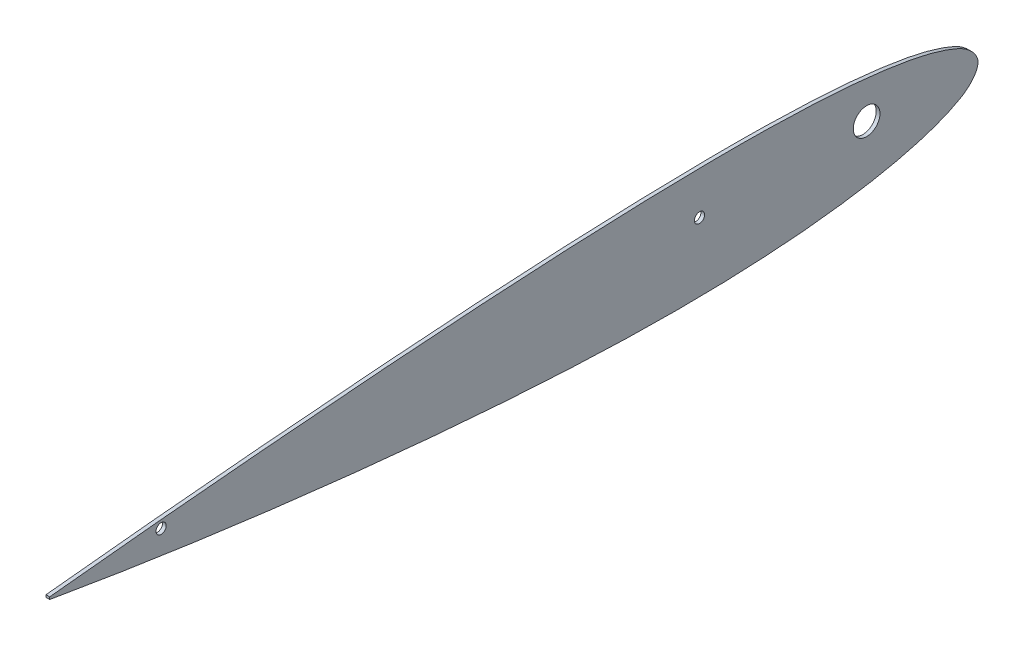
ISO-10303-21;
HEADER;
FILE_DESCRIPTION(('STEP AP214'),'2;1');
FILE_NAME('part.step','',(''),(''),'','','');
FILE_SCHEMA(('AUTOMOTIVE_DESIGN { 1 0 10303 214 1 1 1 1 }'));
ENDSEC;
DATA;
#1=APPLICATION_CONTEXT('core data for automotive mechanical design processes');
#2=APPLICATION_PROTOCOL_DEFINITION('international standard','automotive_design',2000,#1);
#3=PRODUCT_CONTEXT('',#1,'mechanical');
#4=PRODUCT('Part','Part','',(#3));
#5=PRODUCT_RELATED_PRODUCT_CATEGORY('part','',(#4));
#6=PRODUCT_DEFINITION_FORMATION('','',#4);
#7=PRODUCT_DEFINITION_CONTEXT('part definition',#1,'design');
#8=PRODUCT_DEFINITION('design','',#6,#7);
#9=PRODUCT_DEFINITION_SHAPE('','',#8);
#10=(LENGTH_UNIT() NAMED_UNIT(*) SI_UNIT(.MILLI.,.METRE.));
#11=(NAMED_UNIT(*) PLANE_ANGLE_UNIT() SI_UNIT($,.RADIAN.));
#12=(NAMED_UNIT(*) SI_UNIT($,.STERADIAN.) SOLID_ANGLE_UNIT());
#13=UNCERTAINTY_MEASURE_WITH_UNIT(LENGTH_MEASURE(1.E-05),#10,'distance_accuracy_value','');
#14=(GEOMETRIC_REPRESENTATION_CONTEXT(3) GLOBAL_UNCERTAINTY_ASSIGNED_CONTEXT((#13)) GLOBAL_UNIT_ASSIGNED_CONTEXT((#10,
#11,#12)) REPRESENTATION_CONTEXT('',''));
#15=CARTESIAN_POINT('',(0.,0.,0.));
#16=DIRECTION('',(0.,0.,1.));
#17=DIRECTION('',(1.,0.,0.));
#18=AXIS2_PLACEMENT_3D('',#15,#16,#17);
#19=CARTESIAN_POINT('',(2.,0.629990217552887,500.000391464518));
#20=CARTESIAN_POINT('',(2.,1.51034175126108,491.626931192415));
#21=CARTESIAN_POINT('',(2.,3.26887282570173,474.900669551157));
#22=CARTESIAN_POINT('',(2.,6.57755116135666,441.478024901199));
#23=CARTESIAN_POINT('',(2.,10.4506062125908,399.75968393433));
#24=CARTESIAN_POINT('',(2.,14.7211772633211,349.744612358999));
#25=CARTESIAN_POINT('',(2.,18.5892936363402,299.79981397499));
#26=CARTESIAN_POINT('',(2.,21.8953680882773,249.907411219679));
#27=CARTESIAN_POINT('',(2.,24.3721381282665,200.117341253644));
#28=CARTESIAN_POINT('',(2.,25.5592845892216,158.671272756386));
#29=CARTESIAN_POINT('',(2.,25.7289283148688,125.568151797292));
#30=CARTESIAN_POINT('',(2.,25.3055282165276,100.710481376144));
#31=CARTESIAN_POINT('',(2.,24.1073804683215,75.7898961207131));
#32=CARTESIAN_POINT('',(2.,22.1864488821257,54.9819243378212));
#33=CARTESIAN_POINT('',(2.,19.6696784029122,38.2826088337678));
#34=CARTESIAN_POINT('',(2.,17.0750296516133,25.6214069700581));
#35=CARTESIAN_POINT('',(2.,13.6752084008964,14.8526657949537));
#36=CARTESIAN_POINT('',(2.,9.34354366510016,5.48115663478327));
#37=CARTESIAN_POINT('',(2.,0.464115322413722,-3.05752115720103));
#38=CARTESIAN_POINT('',(2.,-9.25154410103212,4.56290295265366));
#39=CARTESIAN_POINT('',(2.,-14.4440662930239,13.5406941054071));
#40=CARTESIAN_POINT('',(2.,-18.8274349648793,24.0380165714359));
#41=CARTESIAN_POINT('',(2.,-22.5007793217448,36.5482015339728));
#42=CARTESIAN_POINT('',(2.,-26.3525527265861,53.1842112016427));
#43=CARTESIAN_POINT('',(2.,-29.7119988712829,74.0823714612029));
#44=CARTESIAN_POINT('',(2.,-32.3644363625232,99.2384453704401));
#45=CARTESIAN_POINT('',(2.,-33.8981341858284,124.417757669678));
#46=CARTESIAN_POINT('',(2.,-34.8427950054599,158.001666326896));
#47=CARTESIAN_POINT('',(2.,-34.1504063706173,199.943449697897));
#48=CARTESIAN_POINT('',(2.,-31.3977787192568,250.163999372924));
#49=CARTESIAN_POINT('',(2.,-27.3265644902248,300.273534791434));
#50=CARTESIAN_POINT('',(2.,-22.1260328840813,350.326490164144));
#51=CARTESIAN_POINT('',(2.,-15.9835680884625,400.319447211552));
#52=CARTESIAN_POINT('',(2.,-10.0706032745586,441.907987538052));
#53=CARTESIAN_POINT('',(2.,-4.87163762297868,475.129555299215));
#54=CARTESIAN_POINT('',(2.,-2.043748956896,491.710316251138));
#55=CARTESIAN_POINT('',(2.,-0.629990217552892,499.999608535483));
#56=B_SPLINE_CURVE_WITH_KNOTS('',3,(#19,#20,#21,#22,#23,#24,#25,#26,#27,#28,#29,#30,#31,#32,#33,
#34,#35,#36,#37,#38,#39,#40,#41,#42,#43,#44,#45,#46,#47,#48,#49,#50,#51,#52,#53,#54,#55),
.UNSPECIFIED.,.F.,.F.,(4,1,1,1,1,1,1,1,1,1,1,1,1,1,1,1,1,1,1,1,1,1,1,1,1,1,1,1,1,1,1,1,1,1,4),
(0.,0.0247898444409783,0.049518527668585,0.0988869468263506,0.148148302407342,0.19731261260843,
0.246378146970664,0.295363956929404,0.34408374332352,0.368442721404916,0.392825641810401,
0.41727490319434,0.441884458853984,0.454325923101425,0.466947515660677,0.480022900195665,
0.487092053261674,0.498227884101779,0.509373674616872,0.516476673346114,0.529639133387933,
0.542377969647895,0.5549439711343,0.579861194114865,0.604653843655577,0.629394084082987,
0.654115914552988,0.703559499032186,0.752843021958462,0.802183907321177,0.851568359011207,
0.900997535580195,0.950476794201679,0.975241647297708,1.),.UNSPECIFIED.);
#57=DIRECTION('',(-1.,0.,0.));
#58=VECTOR('',#57,1.);
#59=SURFACE_OF_LINEAR_EXTRUSION('',#56,#58);
#60=CARTESIAN_POINT('',(0.,0.629990217552887,500.000391464518));
#61=CARTESIAN_POINT('',(0.,1.51034175126108,491.626931192415));
#62=CARTESIAN_POINT('',(0.,3.26887282570173,474.900669551157));
#63=CARTESIAN_POINT('',(0.,6.57755116135666,441.478024901199));
#64=CARTESIAN_POINT('',(0.,10.4506062125908,399.75968393433));
#65=CARTESIAN_POINT('',(0.,14.7211772633211,349.744612358999));
#66=CARTESIAN_POINT('',(0.,18.5892936363402,299.79981397499));
#67=CARTESIAN_POINT('',(0.,21.8953680882773,249.907411219679));
#68=CARTESIAN_POINT('',(0.,24.3721381282665,200.117341253644));
#69=CARTESIAN_POINT('',(0.,25.5592845892216,158.671272756386));
#70=CARTESIAN_POINT('',(0.,25.7289283148688,125.568151797292));
#71=CARTESIAN_POINT('',(0.,25.3055282165276,100.710481376144));
#72=CARTESIAN_POINT('',(0.,24.1073804683215,75.7898961207131));
#73=CARTESIAN_POINT('',(0.,22.1864488821257,54.9819243378212));
#74=CARTESIAN_POINT('',(0.,19.6696784029122,38.2826088337678));
#75=CARTESIAN_POINT('',(0.,17.0750296516133,25.6214069700581));
#76=CARTESIAN_POINT('',(0.,13.6752084008964,14.8526657949537));
#77=CARTESIAN_POINT('',(0.,9.34354366510016,5.48115663478327));
#78=CARTESIAN_POINT('',(0.,0.464115322413722,-3.05752115720103));
#79=CARTESIAN_POINT('',(0.,-9.25154410103212,4.56290295265366));
#80=CARTESIAN_POINT('',(0.,-14.4440662930239,13.5406941054071));
#81=CARTESIAN_POINT('',(0.,-18.8274349648793,24.0380165714359));
#82=CARTESIAN_POINT('',(0.,-22.5007793217448,36.5482015339728));
#83=CARTESIAN_POINT('',(0.,-26.3525527265861,53.1842112016427));
#84=CARTESIAN_POINT('',(0.,-29.7119988712829,74.0823714612029));
#85=CARTESIAN_POINT('',(0.,-32.3644363625232,99.2384453704401));
#86=CARTESIAN_POINT('',(0.,-33.8981341858284,124.417757669678));
#87=CARTESIAN_POINT('',(0.,-34.8427950054599,158.001666326896));
#88=CARTESIAN_POINT('',(0.,-34.1504063706173,199.943449697897));
#89=CARTESIAN_POINT('',(0.,-31.3977787192568,250.163999372924));
#90=CARTESIAN_POINT('',(0.,-27.3265644902248,300.273534791434));
#91=CARTESIAN_POINT('',(0.,-22.1260328840813,350.326490164144));
#92=CARTESIAN_POINT('',(0.,-15.9835680884625,400.319447211552));
#93=CARTESIAN_POINT('',(0.,-10.0706032745586,441.907987538052));
#94=CARTESIAN_POINT('',(0.,-4.87163762297868,475.129555299215));
#95=CARTESIAN_POINT('',(0.,-2.043748956896,491.710316251138));
#96=CARTESIAN_POINT('',(0.,-0.629990217552892,499.999608535483));
#97=B_SPLINE_CURVE_WITH_KNOTS('',3,(#60,#61,#62,#63,#64,#65,#66,#67,#68,#69,#70,#71,#72,#73,#74,
#75,#76,#77,#78,#79,#80,#81,#82,#83,#84,#85,#86,#87,#88,#89,#90,#91,#92,#93,#94,#95,#96),
.UNSPECIFIED.,.F.,.F.,(4,1,1,1,1,1,1,1,1,1,1,1,1,1,1,1,1,1,1,1,1,1,1,1,1,1,1,1,1,1,1,1,1,1,4),
(0.,0.0247898444409783,0.049518527668585,0.0988869468263506,0.148148302407342,0.19731261260843,
0.246378146970664,0.295363956929404,0.34408374332352,0.368442721404916,0.392825641810401,
0.41727490319434,0.441884458853984,0.454325923101425,0.466947515660677,0.480022900195665,
0.487092053261674,0.498227884101779,0.509373674616872,0.516476673346114,0.529639133387933,
0.542377969647895,0.5549439711343,0.579861194114865,0.604653843655577,0.629394084082987,
0.654115914552988,0.703559499032186,0.752843021958462,0.802183907321177,0.851568359011207,
0.900997535580195,0.950476794201679,0.975241647297708,1.),.UNSPECIFIED.);
#98=CARTESIAN_POINT('',(0.,0.629990217552889,500.000391464518));
#99=VERTEX_POINT('',#98);
#100=CARTESIAN_POINT('',(0.,-0.629990217552889,499.999608535482));
#101=VERTEX_POINT('',#100);
#102=EDGE_CURVE('E67',#99,#101,#97,.T.);
#103=ORIENTED_EDGE('',*,*,#102,.F.);
#104=DIRECTION('',(-1.,0.,0.));
#105=VECTOR('',#104,1.);
#106=CARTESIAN_POINT('',(2.,0.629990217552889,500.000391464518));
#107=LINE('',#106,#105);
#108=CARTESIAN_POINT('',(2.,0.629990217552889,500.000391464518));
#109=VERTEX_POINT('',#108);
#110=EDGE_CURVE('E47',#109,#99,#107,.T.);
#111=ORIENTED_EDGE('',*,*,#110,.F.);
#112=CARTESIAN_POINT('',(2.,-0.629990217552889,499.999608535482));
#113=VERTEX_POINT('',#112);
#114=EDGE_CURVE('E68',#109,#113,#56,.T.);
#115=ORIENTED_EDGE('',*,*,#114,.T.);
#116=DIRECTION('',(-1.,0.,0.));
#117=VECTOR('',#116,1.);
#118=CARTESIAN_POINT('',(2.,-0.629990217552889,499.999608535482));
#119=LINE('',#118,#117);
#120=EDGE_CURVE('E11',#113,#101,#119,.T.);
#121=ORIENTED_EDGE('',*,*,#120,.T.);
#122=EDGE_LOOP('',(#103,#111,#115,#121));
#123=FACE_BOUND('',#122,.T.);
#124=ADVANCED_FACE('F37',(#123),#59,.T.);
#125=CARTESIAN_POINT('',(2.,0.629990217552889,500.000391464518));
#126=DIRECTION('',(0.,0.000621381778835644,-0.999999806942324));
#127=DIRECTION('',(0.,-0.999999806942324,-0.000621381778835644));
#128=AXIS2_PLACEMENT_3D('',#125,#126,#127);
#129=PLANE('',#128);
#130=DIRECTION('',(0.,0.999999806942324,0.000621381778835644));
#131=VECTOR('',#130,1.);
#132=CARTESIAN_POINT('',(0.,0.629990217552889,500.000391464518));
#133=LINE('',#132,#131);
#134=EDGE_CURVE('E62',#101,#99,#133,.T.);
#135=ORIENTED_EDGE('',*,*,#134,.F.);
#136=ORIENTED_EDGE('',*,*,#120,.F.);
#137=DIRECTION('',(0.,0.999999806942324,0.000621381778835644));
#138=VECTOR('',#137,1.);
#139=CARTESIAN_POINT('',(2.,0.629990217552889,500.000391464518));
#140=LINE('',#139,#138);
#141=EDGE_CURVE('E56',#113,#109,#140,.T.);
#142=ORIENTED_EDGE('',*,*,#141,.T.);
#143=ORIENTED_EDGE('',*,*,#110,.T.);
#144=EDGE_LOOP('',(#135,#136,#142,#143));
#145=FACE_BOUND('',#144,.T.);
#146=ADVANCED_FACE('F71',(#145),#129,.F.);
#147=CARTESIAN_POINT('',(2.,-1.37907631788879,0.144206161930642));
#148=DIRECTION('',(1.,0.,0.));
#149=DIRECTION('',(0.,0.,1.));
#150=AXIS2_PLACEMENT_3D('',#147,#148,#149);
#151=PLANE('',#150);
#152=CARTESIAN_POINT('',(2.,2.5000018824215,60.));
#153=DIRECTION('',(-1.,0.,0.));
#154=DIRECTION('',(0.,0.,1.));
#155=AXIS2_PLACEMENT_3D('',#152,#153,#154);
#156=CIRCLE('',#155,7.19536101);
#157=CARTESIAN_POINT('',(2.,2.5000018824215,67.19536101));
#158=VERTEX_POINT('',#157);
#159=EDGE_CURVE('E87',#158,#158,#156,.T.);
#160=ORIENTED_EDGE('',*,*,#159,.T.);
#161=EDGE_LOOP('',(#160));
#162=FACE_BOUND('',#161,.T.);
#163=CARTESIAN_POINT('',(2.,2.5000018824215,150.));
#164=DIRECTION('',(-1.,0.,0.));
#165=DIRECTION('',(0.,0.,1.));
#166=AXIS2_PLACEMENT_3D('',#163,#164,#165);
#167=CIRCLE('',#166,2.75000000000001);
#168=CARTESIAN_POINT('',(2.,2.5000018824215,152.75));
#169=VERTEX_POINT('',#168);
#170=EDGE_CURVE('E128',#169,#169,#167,.T.);
#171=ORIENTED_EDGE('',*,*,#170,.T.);
#172=EDGE_LOOP('',(#171));
#173=FACE_BOUND('',#172,.T.);
#174=CARTESIAN_POINT('',(2.,2.50000188242148,440.001541872454));
#175=DIRECTION('',(-1.,0.,0.));
#176=DIRECTION('',(0.,0.,1.));
#177=AXIS2_PLACEMENT_3D('',#174,#175,#176);
#178=CIRCLE('',#177,2.75000000000004);
#179=CARTESIAN_POINT('',(2.,2.50000188242148,442.751541872454));
#180=VERTEX_POINT('',#179);
#181=EDGE_CURVE('E131',#180,#180,#178,.T.);
#182=ORIENTED_EDGE('',*,*,#181,.T.);
#183=EDGE_LOOP('',(#182));
#184=FACE_BOUND('',#183,.T.);
#185=ORIENTED_EDGE('',*,*,#114,.F.);
#186=ORIENTED_EDGE('',*,*,#141,.F.);
#187=EDGE_LOOP('',(#185,#186));
#188=FACE_BOUND('',#187,.T.);
#189=ADVANCED_FACE('F96',(#162,#173,#184,#188),#151,.T.);
#190=CARTESIAN_POINT('',(0.,-1.37907631788879,0.144206161930642));
#191=DIRECTION('',(1.,0.,0.));
#192=DIRECTION('',(0.,0.,1.));
#193=AXIS2_PLACEMENT_3D('',#190,#191,#192);
#194=PLANE('',#193);
#195=CARTESIAN_POINT('',(0.,2.5000018824215,60.));
#196=DIRECTION('',(-1.,0.,0.));
#197=DIRECTION('',(0.,0.,1.));
#198=AXIS2_PLACEMENT_3D('',#195,#196,#197);
#199=CIRCLE('',#198,7.19536101);
#200=CARTESIAN_POINT('',(0.,2.5000018824215,67.19536101));
#201=VERTEX_POINT('',#200);
#202=EDGE_CURVE('E41',#201,#201,#199,.T.);
#203=ORIENTED_EDGE('',*,*,#202,.F.);
#204=EDGE_LOOP('',(#203));
#205=FACE_BOUND('',#204,.T.);
#206=CARTESIAN_POINT('',(0.,2.5000018824215,150.));
#207=DIRECTION('',(-1.,0.,0.));
#208=DIRECTION('',(0.,0.,1.));
#209=AXIS2_PLACEMENT_3D('',#206,#207,#208);
#210=CIRCLE('',#209,2.75000000000001);
#211=CARTESIAN_POINT('',(0.,2.5000018824215,152.75));
#212=VERTEX_POINT('',#211);
#213=EDGE_CURVE('E77',#212,#212,#210,.T.);
#214=ORIENTED_EDGE('',*,*,#213,.F.);
#215=EDGE_LOOP('',(#214));
#216=FACE_BOUND('',#215,.T.);
#217=CARTESIAN_POINT('',(0.,2.50000188242148,440.001541872454));
#218=DIRECTION('',(-1.,0.,0.));
#219=DIRECTION('',(0.,0.,1.));
#220=AXIS2_PLACEMENT_3D('',#217,#218,#219);
#221=CIRCLE('',#220,2.75000000000004);
#222=CARTESIAN_POINT('',(0.,2.50000188242148,442.751541872454));
#223=VERTEX_POINT('',#222);
#224=EDGE_CURVE('E85',#223,#223,#221,.T.);
#225=ORIENTED_EDGE('',*,*,#224,.F.);
#226=EDGE_LOOP('',(#225));
#227=FACE_BOUND('',#226,.T.);
#228=ORIENTED_EDGE('',*,*,#102,.T.);
#229=ORIENTED_EDGE('',*,*,#134,.T.);
#230=EDGE_LOOP('',(#228,#229));
#231=FACE_BOUND('',#230,.T.);
#232=ADVANCED_FACE('F65',(#205,#216,#227,#231),#194,.F.);
#233=CARTESIAN_POINT('',(-1.2E-05,2.50000188242148,440.001541872454));
#234=DIRECTION('',(1.,0.,0.));
#235=DIRECTION('',(0.,0.,1.));
#236=AXIS2_PLACEMENT_3D('',#233,#234,#235);
#237=CYLINDRICAL_SURFACE('',#236,2.75000000000004);
#238=CARTESIAN_POINT('',(2.,2.50000188242148,442.751541872454));
#239=CARTESIAN_POINT('',(1.97916666666667,2.50000188242148,442.751541872454));
#240=CARTESIAN_POINT('',(1.95833333333333,2.50000188242148,442.751541872454));
#241=CARTESIAN_POINT('',(1.91666666666667,2.50000188242148,442.751541872454));
#242=CARTESIAN_POINT('',(1.89583333333333,2.50000188242148,442.751541872454));
#243=CARTESIAN_POINT('',(1.85416666666667,2.50000188242148,442.751541872454));
#244=CARTESIAN_POINT('',(1.83333333333333,2.50000188242148,442.751541872454));
#245=CARTESIAN_POINT('',(1.79166666666667,2.50000188242148,442.751541872454));
#246=CARTESIAN_POINT('',(1.77083333333333,2.50000188242148,442.751541872454));
#247=CARTESIAN_POINT('',(1.72916666666667,2.50000188242148,442.751541872454));
#248=CARTESIAN_POINT('',(1.70833333333333,2.50000188242148,442.751541872454));
#249=CARTESIAN_POINT('',(1.66666666666667,2.50000188242148,442.751541872454));
#250=CARTESIAN_POINT('',(1.64583333333333,2.50000188242148,442.751541872454));
#251=CARTESIAN_POINT('',(1.60416666666667,2.50000188242148,442.751541872454));
#252=CARTESIAN_POINT('',(1.58333333333333,2.50000188242148,442.751541872454));
#253=CARTESIAN_POINT('',(1.54166666666667,2.50000188242148,442.751541872454));
#254=CARTESIAN_POINT('',(1.52083333333333,2.50000188242148,442.751541872454));
#255=CARTESIAN_POINT('',(1.47916666666667,2.50000188242148,442.751541872454));
#256=CARTESIAN_POINT('',(1.45833333333333,2.50000188242148,442.751541872454));
#257=CARTESIAN_POINT('',(1.41666666666667,2.50000188242148,442.751541872454));
#258=CARTESIAN_POINT('',(1.39583333333333,2.50000188242148,442.751541872454));
#259=CARTESIAN_POINT('',(1.35416666666667,2.50000188242148,442.751541872454));
#260=CARTESIAN_POINT('',(1.33333333333333,2.50000188242148,442.751541872454));
#261=CARTESIAN_POINT('',(1.29166666666667,2.50000188242148,442.751541872454));
#262=CARTESIAN_POINT('',(1.27083333333333,2.50000188242148,442.751541872454));
#263=CARTESIAN_POINT('',(1.22916666666667,2.50000188242148,442.751541872454));
#264=CARTESIAN_POINT('',(1.20833333333333,2.50000188242148,442.751541872454));
#265=CARTESIAN_POINT('',(1.16666666666667,2.50000188242148,442.751541872454));
#266=CARTESIAN_POINT('',(1.14583333333333,2.50000188242148,442.751541872454));
#267=CARTESIAN_POINT('',(1.10416666666667,2.50000188242148,442.751541872454));
#268=CARTESIAN_POINT('',(1.08333333333333,2.50000188242148,442.751541872454));
#269=CARTESIAN_POINT('',(1.04166666666667,2.50000188242148,442.751541872454));
#270=CARTESIAN_POINT('',(1.02083333333333,2.50000188242148,442.751541872454));
#271=CARTESIAN_POINT('',(0.979166666666667,2.50000188242148,442.751541872454));
#272=CARTESIAN_POINT('',(0.958333333333334,2.50000188242148,442.751541872454));
#273=CARTESIAN_POINT('',(0.916666666666667,2.50000188242148,442.751541872454));
#274=CARTESIAN_POINT('',(0.895833333333334,2.50000188242148,442.751541872454));
#275=CARTESIAN_POINT('',(0.854166666666667,2.50000188242148,442.751541872454));
#276=CARTESIAN_POINT('',(0.833333333333334,2.50000188242148,442.751541872454));
#277=CARTESIAN_POINT('',(0.791666666666667,2.50000188242148,442.751541872454));
#278=CARTESIAN_POINT('',(0.770833333333334,2.50000188242148,442.751541872454));
#279=CARTESIAN_POINT('',(0.729166666666667,2.50000188242148,442.751541872454));
#280=CARTESIAN_POINT('',(0.708333333333334,2.50000188242148,442.751541872454));
#281=CARTESIAN_POINT('',(0.666666666666667,2.50000188242148,442.751541872454));
#282=CARTESIAN_POINT('',(0.645833333333334,2.50000188242148,442.751541872454));
#283=CARTESIAN_POINT('',(0.604166666666667,2.50000188242148,442.751541872454));
#284=CARTESIAN_POINT('',(0.583333333333333,2.50000188242148,442.751541872454));
#285=CARTESIAN_POINT('',(0.541666666666667,2.50000188242148,442.751541872454));
#286=CARTESIAN_POINT('',(0.520833333333333,2.50000188242148,442.751541872454));
#287=CARTESIAN_POINT('',(0.479166666666667,2.50000188242148,442.751541872454));
#288=CARTESIAN_POINT('',(0.458333333333334,2.50000188242148,442.751541872454));
#289=CARTESIAN_POINT('',(0.416666666666667,2.50000188242148,442.751541872454));
#290=CARTESIAN_POINT('',(0.395833333333334,2.50000188242148,442.751541872454));
#291=CARTESIAN_POINT('',(0.354166666666667,2.50000188242148,442.751541872454));
#292=CARTESIAN_POINT('',(0.333333333333334,2.50000188242148,442.751541872454));
#293=CARTESIAN_POINT('',(0.291666666666667,2.50000188242148,442.751541872454));
#294=CARTESIAN_POINT('',(0.270833333333333,2.50000188242148,442.751541872454));
#295=CARTESIAN_POINT('',(0.229166666666667,2.50000188242148,442.751541872454));
#296=CARTESIAN_POINT('',(0.208333333333333,2.50000188242148,442.751541872454));
#297=CARTESIAN_POINT('',(0.166666666666667,2.50000188242148,442.751541872454));
#298=CARTESIAN_POINT('',(0.145833333333334,2.50000188242148,442.751541872454));
#299=CARTESIAN_POINT('',(0.104166666666667,2.50000188242148,442.751541872454));
#300=CARTESIAN_POINT('',(0.0833333333333336,2.50000188242148,442.751541872454));
#301=CARTESIAN_POINT('',(0.0416666666666669,2.50000188242148,442.751541872454));
#302=CARTESIAN_POINT('',(0.0208333333333335,2.50000188242148,442.751541872454));
#303=CARTESIAN_POINT('',(0.,2.50000188242148,442.751541872454));
#304=B_SPLINE_CURVE_WITH_KNOTS('',3,(#238,#239,#240,#241,#242,#243,#244,#245,#246,#247,#248,
#249,#250,#251,#252,#253,#254,#255,#256,#257,#258,#259,#260,#261,#262,#263,#264,#265,#266,#267,
#268,#269,#270,#271,#272,#273,#274,#275,#276,#277,#278,#279,#280,#281,#282,#283,#284,#285,#286,
#287,#288,#289,#290,#291,#292,#293,#294,#295,#296,#297,#298,#299,#300,#301,#302,#303),
.UNSPECIFIED.,.F.,.F.,(4,2,2,2,2,2,2,2,2,2,2,2,2,2,2,2,2,2,2,2,2,2,2,2,2,2,2,2,2,2,2,2,4),(0.,
0.0624999999999996,0.125,0.1875,0.25,0.3125,0.375,0.4375,0.5,0.5625,0.625,0.6875,0.75,0.8125,
0.875,0.9375,1.,1.0625,1.125,1.1875,1.25,1.3125,1.375,1.4375,1.5,1.5625,1.625,1.6875,1.75,
1.8125,1.875,1.9375,2.),.UNSPECIFIED.);
#305=EDGE_CURVE('BSEAM95',#180,#223,#304,.T.);
#306=ORIENTED_EDGE('',*,*,#181,.F.);
#307=ORIENTED_EDGE('',*,*,#224,.T.);
#308=ORIENTED_EDGE('',*,*,#305,.T.);
#309=ORIENTED_EDGE('',*,*,#305,.F.);
#310=EDGE_LOOP('',(#306,#308,#307,#309));
#311=FACE_BOUND('',#310,.T.);
#312=ADVANCED_FACE('F95',(#311),#237,.F.);
#313=CARTESIAN_POINT('',(-1.2E-05,2.5000018824215,150.));
#314=DIRECTION('',(1.,0.,0.));
#315=DIRECTION('',(0.,0.,1.));
#316=AXIS2_PLACEMENT_3D('',#313,#314,#315);
#317=CYLINDRICAL_SURFACE('',#316,2.75000000000001);
#318=CARTESIAN_POINT('',(2.,2.5000018824215,152.75));
#319=CARTESIAN_POINT('',(1.97916666666667,2.5000018824215,152.75));
#320=CARTESIAN_POINT('',(1.95833333333333,2.5000018824215,152.75));
#321=CARTESIAN_POINT('',(1.91666666666667,2.5000018824215,152.75));
#322=CARTESIAN_POINT('',(1.89583333333333,2.5000018824215,152.75));
#323=CARTESIAN_POINT('',(1.85416666666667,2.5000018824215,152.75));
#324=CARTESIAN_POINT('',(1.83333333333333,2.5000018824215,152.75));
#325=CARTESIAN_POINT('',(1.79166666666667,2.5000018824215,152.75));
#326=CARTESIAN_POINT('',(1.77083333333333,2.5000018824215,152.75));
#327=CARTESIAN_POINT('',(1.72916666666667,2.5000018824215,152.75));
#328=CARTESIAN_POINT('',(1.70833333333333,2.5000018824215,152.75));
#329=CARTESIAN_POINT('',(1.66666666666667,2.5000018824215,152.75));
#330=CARTESIAN_POINT('',(1.64583333333333,2.5000018824215,152.75));
#331=CARTESIAN_POINT('',(1.60416666666667,2.5000018824215,152.75));
#332=CARTESIAN_POINT('',(1.58333333333333,2.5000018824215,152.75));
#333=CARTESIAN_POINT('',(1.54166666666667,2.5000018824215,152.75));
#334=CARTESIAN_POINT('',(1.52083333333333,2.5000018824215,152.75));
#335=CARTESIAN_POINT('',(1.47916666666667,2.5000018824215,152.75));
#336=CARTESIAN_POINT('',(1.45833333333333,2.5000018824215,152.75));
#337=CARTESIAN_POINT('',(1.41666666666667,2.5000018824215,152.75));
#338=CARTESIAN_POINT('',(1.39583333333333,2.5000018824215,152.75));
#339=CARTESIAN_POINT('',(1.35416666666667,2.5000018824215,152.75));
#340=CARTESIAN_POINT('',(1.33333333333333,2.5000018824215,152.75));
#341=CARTESIAN_POINT('',(1.29166666666667,2.5000018824215,152.75));
#342=CARTESIAN_POINT('',(1.27083333333333,2.5000018824215,152.75));
#343=CARTESIAN_POINT('',(1.22916666666667,2.5000018824215,152.75));
#344=CARTESIAN_POINT('',(1.20833333333333,2.5000018824215,152.75));
#345=CARTESIAN_POINT('',(1.16666666666667,2.5000018824215,152.75));
#346=CARTESIAN_POINT('',(1.14583333333333,2.5000018824215,152.75));
#347=CARTESIAN_POINT('',(1.10416666666667,2.5000018824215,152.75));
#348=CARTESIAN_POINT('',(1.08333333333333,2.5000018824215,152.75));
#349=CARTESIAN_POINT('',(1.04166666666667,2.5000018824215,152.75));
#350=CARTESIAN_POINT('',(1.02083333333333,2.5000018824215,152.75));
#351=CARTESIAN_POINT('',(0.979166666666667,2.5000018824215,152.75));
#352=CARTESIAN_POINT('',(0.958333333333334,2.5000018824215,152.75));
#353=CARTESIAN_POINT('',(0.916666666666667,2.5000018824215,152.75));
#354=CARTESIAN_POINT('',(0.895833333333334,2.5000018824215,152.75));
#355=CARTESIAN_POINT('',(0.854166666666667,2.5000018824215,152.75));
#356=CARTESIAN_POINT('',(0.833333333333334,2.5000018824215,152.75));
#357=CARTESIAN_POINT('',(0.791666666666667,2.5000018824215,152.75));
#358=CARTESIAN_POINT('',(0.770833333333334,2.5000018824215,152.75));
#359=CARTESIAN_POINT('',(0.729166666666667,2.5000018824215,152.75));
#360=CARTESIAN_POINT('',(0.708333333333334,2.5000018824215,152.75));
#361=CARTESIAN_POINT('',(0.666666666666667,2.5000018824215,152.75));
#362=CARTESIAN_POINT('',(0.645833333333334,2.5000018824215,152.75));
#363=CARTESIAN_POINT('',(0.604166666666667,2.5000018824215,152.75));
#364=CARTESIAN_POINT('',(0.583333333333333,2.5000018824215,152.75));
#365=CARTESIAN_POINT('',(0.541666666666667,2.5000018824215,152.75));
#366=CARTESIAN_POINT('',(0.520833333333333,2.5000018824215,152.75));
#367=CARTESIAN_POINT('',(0.479166666666667,2.5000018824215,152.75));
#368=CARTESIAN_POINT('',(0.458333333333334,2.5000018824215,152.75));
#369=CARTESIAN_POINT('',(0.416666666666667,2.5000018824215,152.75));
#370=CARTESIAN_POINT('',(0.395833333333334,2.5000018824215,152.75));
#371=CARTESIAN_POINT('',(0.354166666666667,2.5000018824215,152.75));
#372=CARTESIAN_POINT('',(0.333333333333334,2.5000018824215,152.75));
#373=CARTESIAN_POINT('',(0.291666666666667,2.5000018824215,152.75));
#374=CARTESIAN_POINT('',(0.270833333333333,2.5000018824215,152.75));
#375=CARTESIAN_POINT('',(0.229166666666667,2.5000018824215,152.75));
#376=CARTESIAN_POINT('',(0.208333333333333,2.5000018824215,152.75));
#377=CARTESIAN_POINT('',(0.166666666666667,2.5000018824215,152.75));
#378=CARTESIAN_POINT('',(0.145833333333334,2.5000018824215,152.75));
#379=CARTESIAN_POINT('',(0.104166666666667,2.5000018824215,152.75));
#380=CARTESIAN_POINT('',(0.0833333333333336,2.5000018824215,152.75));
#381=CARTESIAN_POINT('',(0.0416666666666669,2.5000018824215,152.75));
#382=CARTESIAN_POINT('',(0.0208333333333335,2.5000018824215,152.75));
#383=CARTESIAN_POINT('',(0.,2.5000018824215,152.75));
#384=B_SPLINE_CURVE_WITH_KNOTS('',3,(#318,#319,#320,#321,#322,#323,#324,#325,#326,#327,#328,
#329,#330,#331,#332,#333,#334,#335,#336,#337,#338,#339,#340,#341,#342,#343,#344,#345,#346,#347,
#348,#349,#350,#351,#352,#353,#354,#355,#356,#357,#358,#359,#360,#361,#362,#363,#364,#365,#366,
#367,#368,#369,#370,#371,#372,#373,#374,#375,#376,#377,#378,#379,#380,#381,#382,#383),
.UNSPECIFIED.,.F.,.F.,(4,2,2,2,2,2,2,2,2,2,2,2,2,2,2,2,2,2,2,2,2,2,2,2,2,2,2,2,2,2,2,2,4),(0.,
0.0624999999999996,0.125,0.1875,0.25,0.3125,0.375,0.4375,0.5,0.5625,0.625,0.6875,0.75,0.8125,
0.875,0.9375,1.,1.0625,1.125,1.1875,1.25,1.3125,1.375,1.4375,1.5,1.5625,1.625,1.6875,1.75,
1.8125,1.875,1.9375,2.),.UNSPECIFIED.);
#385=EDGE_CURVE('BSEAM91',#169,#212,#384,.T.);
#386=ORIENTED_EDGE('',*,*,#170,.F.);
#387=ORIENTED_EDGE('',*,*,#213,.T.);
#388=ORIENTED_EDGE('',*,*,#385,.T.);
#389=ORIENTED_EDGE('',*,*,#385,.F.);
#390=EDGE_LOOP('',(#386,#388,#387,#389));
#391=FACE_BOUND('',#390,.T.);
#392=ADVANCED_FACE('F91',(#391),#317,.F.);
#393=CARTESIAN_POINT('',(-1.2E-05,2.5000018824215,60.));
#394=DIRECTION('',(1.,0.,0.));
#395=DIRECTION('',(0.,0.,1.));
#396=AXIS2_PLACEMENT_3D('',#393,#394,#395);
#397=CYLINDRICAL_SURFACE('',#396,7.19536101);
#398=CARTESIAN_POINT('',(2.,2.5000018824215,67.19536101));
#399=CARTESIAN_POINT('',(1.97916666666667,2.5000018824215,67.19536101));
#400=CARTESIAN_POINT('',(1.95833333333333,2.5000018824215,67.19536101));
#401=CARTESIAN_POINT('',(1.91666666666667,2.5000018824215,67.19536101));
#402=CARTESIAN_POINT('',(1.89583333333333,2.5000018824215,67.19536101));
#403=CARTESIAN_POINT('',(1.85416666666667,2.5000018824215,67.19536101));
#404=CARTESIAN_POINT('',(1.83333333333333,2.5000018824215,67.19536101));
#405=CARTESIAN_POINT('',(1.79166666666667,2.5000018824215,67.19536101));
#406=CARTESIAN_POINT('',(1.77083333333333,2.5000018824215,67.19536101));
#407=CARTESIAN_POINT('',(1.72916666666667,2.5000018824215,67.19536101));
#408=CARTESIAN_POINT('',(1.70833333333333,2.5000018824215,67.19536101));
#409=CARTESIAN_POINT('',(1.66666666666667,2.5000018824215,67.19536101));
#410=CARTESIAN_POINT('',(1.64583333333333,2.5000018824215,67.19536101));
#411=CARTESIAN_POINT('',(1.60416666666667,2.5000018824215,67.19536101));
#412=CARTESIAN_POINT('',(1.58333333333333,2.5000018824215,67.19536101));
#413=CARTESIAN_POINT('',(1.54166666666667,2.5000018824215,67.19536101));
#414=CARTESIAN_POINT('',(1.52083333333333,2.5000018824215,67.19536101));
#415=CARTESIAN_POINT('',(1.47916666666667,2.5000018824215,67.19536101));
#416=CARTESIAN_POINT('',(1.45833333333333,2.5000018824215,67.19536101));
#417=CARTESIAN_POINT('',(1.41666666666667,2.5000018824215,67.19536101));
#418=CARTESIAN_POINT('',(1.39583333333333,2.5000018824215,67.19536101));
#419=CARTESIAN_POINT('',(1.35416666666667,2.5000018824215,67.19536101));
#420=CARTESIAN_POINT('',(1.33333333333333,2.5000018824215,67.19536101));
#421=CARTESIAN_POINT('',(1.29166666666667,2.5000018824215,67.19536101));
#422=CARTESIAN_POINT('',(1.27083333333333,2.5000018824215,67.19536101));
#423=CARTESIAN_POINT('',(1.22916666666667,2.5000018824215,67.19536101));
#424=CARTESIAN_POINT('',(1.20833333333333,2.5000018824215,67.19536101));
#425=CARTESIAN_POINT('',(1.16666666666667,2.5000018824215,67.19536101));
#426=CARTESIAN_POINT('',(1.14583333333333,2.5000018824215,67.19536101));
#427=CARTESIAN_POINT('',(1.10416666666667,2.5000018824215,67.19536101));
#428=CARTESIAN_POINT('',(1.08333333333333,2.5000018824215,67.19536101));
#429=CARTESIAN_POINT('',(1.04166666666667,2.5000018824215,67.19536101));
#430=CARTESIAN_POINT('',(1.02083333333333,2.5000018824215,67.19536101));
#431=CARTESIAN_POINT('',(0.979166666666667,2.5000018824215,67.19536101));
#432=CARTESIAN_POINT('',(0.958333333333334,2.5000018824215,67.19536101));
#433=CARTESIAN_POINT('',(0.916666666666667,2.5000018824215,67.19536101));
#434=CARTESIAN_POINT('',(0.895833333333334,2.5000018824215,67.19536101));
#435=CARTESIAN_POINT('',(0.854166666666667,2.5000018824215,67.19536101));
#436=CARTESIAN_POINT('',(0.833333333333334,2.5000018824215,67.19536101));
#437=CARTESIAN_POINT('',(0.791666666666667,2.5000018824215,67.19536101));
#438=CARTESIAN_POINT('',(0.770833333333334,2.5000018824215,67.19536101));
#439=CARTESIAN_POINT('',(0.729166666666667,2.5000018824215,67.19536101));
#440=CARTESIAN_POINT('',(0.708333333333334,2.5000018824215,67.19536101));
#441=CARTESIAN_POINT('',(0.666666666666667,2.5000018824215,67.19536101));
#442=CARTESIAN_POINT('',(0.645833333333334,2.5000018824215,67.19536101));
#443=CARTESIAN_POINT('',(0.604166666666667,2.5000018824215,67.19536101));
#444=CARTESIAN_POINT('',(0.583333333333333,2.5000018824215,67.19536101));
#445=CARTESIAN_POINT('',(0.541666666666667,2.5000018824215,67.19536101));
#446=CARTESIAN_POINT('',(0.520833333333333,2.5000018824215,67.19536101));
#447=CARTESIAN_POINT('',(0.479166666666667,2.5000018824215,67.19536101));
#448=CARTESIAN_POINT('',(0.458333333333334,2.5000018824215,67.19536101));
#449=CARTESIAN_POINT('',(0.416666666666667,2.5000018824215,67.19536101));
#450=CARTESIAN_POINT('',(0.395833333333334,2.5000018824215,67.19536101));
#451=CARTESIAN_POINT('',(0.354166666666667,2.5000018824215,67.19536101));
#452=CARTESIAN_POINT('',(0.333333333333334,2.5000018824215,67.19536101));
#453=CARTESIAN_POINT('',(0.291666666666667,2.5000018824215,67.19536101));
#454=CARTESIAN_POINT('',(0.270833333333333,2.5000018824215,67.19536101));
#455=CARTESIAN_POINT('',(0.229166666666667,2.5000018824215,67.19536101));
#456=CARTESIAN_POINT('',(0.208333333333333,2.5000018824215,67.19536101));
#457=CARTESIAN_POINT('',(0.166666666666667,2.5000018824215,67.19536101));
#458=CARTESIAN_POINT('',(0.145833333333334,2.5000018824215,67.19536101));
#459=CARTESIAN_POINT('',(0.104166666666667,2.5000018824215,67.19536101));
#460=CARTESIAN_POINT('',(0.0833333333333336,2.5000018824215,67.19536101));
#461=CARTESIAN_POINT('',(0.0416666666666669,2.5000018824215,67.19536101));
#462=CARTESIAN_POINT('',(0.0208333333333335,2.5000018824215,67.19536101));
#463=CARTESIAN_POINT('',(0.,2.5000018824215,67.19536101));
#464=B_SPLINE_CURVE_WITH_KNOTS('',3,(#398,#399,#400,#401,#402,#403,#404,#405,#406,#407,#408,
#409,#410,#411,#412,#413,#414,#415,#416,#417,#418,#419,#420,#421,#422,#423,#424,#425,#426,#427,
#428,#429,#430,#431,#432,#433,#434,#435,#436,#437,#438,#439,#440,#441,#442,#443,#444,#445,#446,
#447,#448,#449,#450,#451,#452,#453,#454,#455,#456,#457,#458,#459,#460,#461,#462,#463),
.UNSPECIFIED.,.F.,.F.,(4,2,2,2,2,2,2,2,2,2,2,2,2,2,2,2,2,2,2,2,2,2,2,2,2,2,2,2,2,2,2,2,4),(0.,
0.0624999999999996,0.125,0.1875,0.25,0.3125,0.375,0.4375,0.5,0.5625,0.625,0.6875,0.75,0.8125,
0.875,0.9375,1.,1.0625,1.125,1.1875,1.25,1.3125,1.375,1.4375,1.5,1.5625,1.625,1.6875,1.75,
1.8125,1.875,1.9375,2.),.UNSPECIFIED.);
#465=EDGE_CURVE('BSEAM107',#158,#201,#464,.T.);
#466=ORIENTED_EDGE('',*,*,#159,.F.);
#467=ORIENTED_EDGE('',*,*,#202,.T.);
#468=ORIENTED_EDGE('',*,*,#465,.T.);
#469=ORIENTED_EDGE('',*,*,#465,.F.);
#470=EDGE_LOOP('',(#466,#468,#467,#469));
#471=FACE_BOUND('',#470,.T.);
#472=ADVANCED_FACE('F107',(#471),#397,.F.);
#473=CLOSED_SHELL('',(#124,#146,#189,#232,#312,#392,#472));
#474=MANIFOLD_SOLID_BREP('B2',#473);
#475=ADVANCED_BREP_SHAPE_REPRESENTATION('',(#18,#474),#14);
#476=SHAPE_DEFINITION_REPRESENTATION(#9,#475);
ENDSEC;
END-ISO-10303-21;
